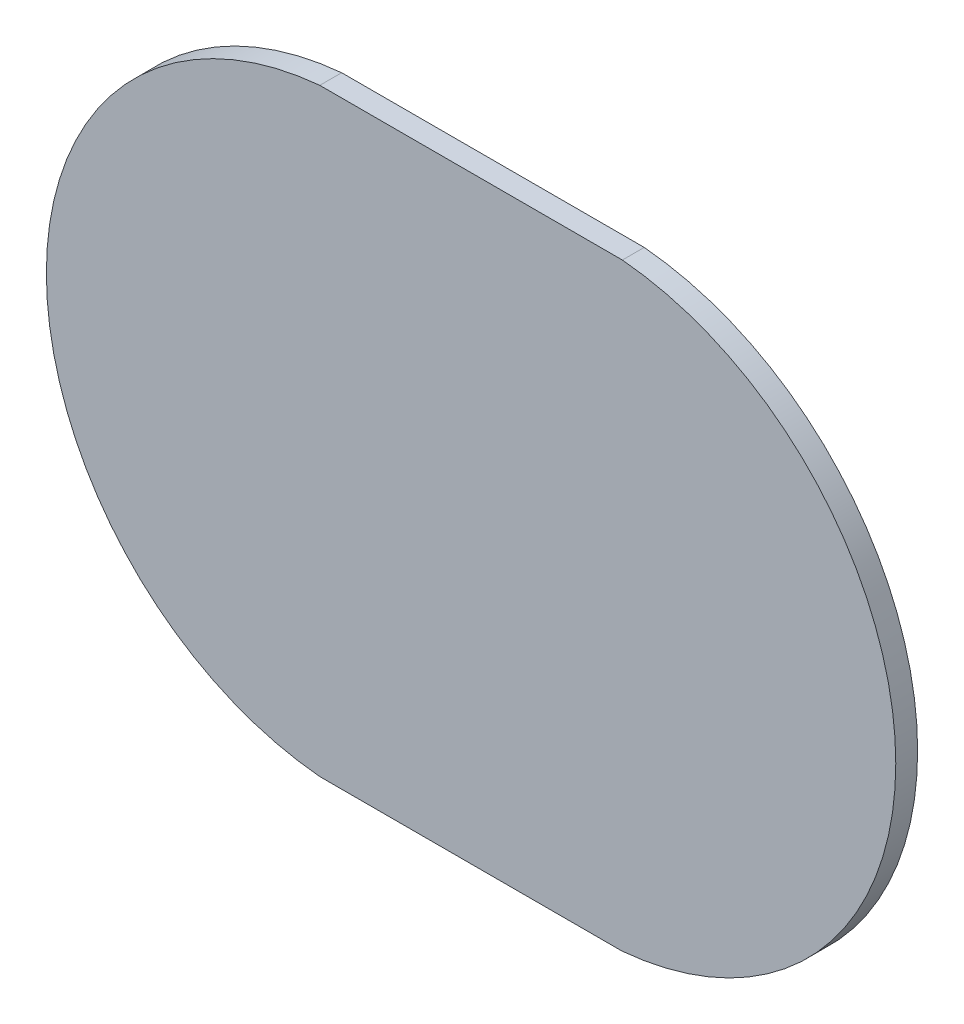
ISO-10303-21;
HEADER;
FILE_DESCRIPTION(('STEP AP214'),'2;1');
FILE_NAME('part.step','',(''),(''),'','','');
FILE_SCHEMA(('AUTOMOTIVE_DESIGN { 1 0 10303 214 1 1 1 1 }'));
ENDSEC;
DATA;
#1=APPLICATION_CONTEXT('core data for automotive mechanical design processes');
#2=APPLICATION_PROTOCOL_DEFINITION('international standard','automotive_design',2000,#1);
#3=PRODUCT_CONTEXT('',#1,'mechanical');
#4=PRODUCT('Part','Part','',(#3));
#5=PRODUCT_RELATED_PRODUCT_CATEGORY('part','',(#4));
#6=PRODUCT_DEFINITION_FORMATION('','',#4);
#7=PRODUCT_DEFINITION_CONTEXT('part definition',#1,'design');
#8=PRODUCT_DEFINITION('design','',#6,#7);
#9=PRODUCT_DEFINITION_SHAPE('','',#8);
#10=(LENGTH_UNIT() NAMED_UNIT(*) SI_UNIT(.MILLI.,.METRE.));
#11=(NAMED_UNIT(*) PLANE_ANGLE_UNIT() SI_UNIT($,.RADIAN.));
#12=(NAMED_UNIT(*) SI_UNIT($,.STERADIAN.) SOLID_ANGLE_UNIT());
#13=UNCERTAINTY_MEASURE_WITH_UNIT(LENGTH_MEASURE(1.E-05),#10,'distance_accuracy_value','');
#14=(GEOMETRIC_REPRESENTATION_CONTEXT(3) GLOBAL_UNCERTAINTY_ASSIGNED_CONTEXT((#13)) GLOBAL_UNIT_ASSIGNED_CONTEXT((#10,
#11,#12)) REPRESENTATION_CONTEXT('',''));
#15=CARTESIAN_POINT('',(0.,0.,0.));
#16=DIRECTION('',(0.,0.,1.));
#17=DIRECTION('',(1.,0.,0.));
#18=AXIS2_PLACEMENT_3D('',#15,#16,#17);
#19=CARTESIAN_POINT('',(-12.3042138671329,-1.03740541843096,-11.6112275560423));
#20=DIRECTION('',(0.,0.,1.));
#21=DIRECTION('',(0.,-1.,0.));
#22=AXIS2_PLACEMENT_3D('',#19,#20,#21);
#23=PLANE('',#22);
#24=DIRECTION('',(1.,0.,0.));
#25=VECTOR('',#24,1.);
#26=CARTESIAN_POINT('',(14.8179873780138,-5.40921753651415,-11.6112275560423));
#27=LINE('',#26,#25);
#28=CARTESIAN_POINT('',(14.8179873780138,-5.40921753651415,-11.6112275560423));
#29=VERTEX_POINT('',#28);
#30=CARTESIAN_POINT('',(15.5379702301806,-5.40921753651415,-11.6112275560423));
#31=VERTEX_POINT('',#30);
#32=EDGE_CURVE('E65',#29,#31,#27,.T.);
#33=ORIENTED_EDGE('',*,*,#32,.F.);
#34=CARTESIAN_POINT('',(14.8825373130822,-6.12148168911415,-11.6112275560423));
#35=DIRECTION('',(0.,0.,1.));
#36=DIRECTION('',(0.,-1.,0.));
#37=AXIS2_PLACEMENT_3D('',#34,#35,#36);
#38=CIRCLE('',#37,0.715183135424999);
#39=CARTESIAN_POINT('',(14.8179873780138,-6.83374584171415,-11.6112275560423));
#40=VERTEX_POINT('',#39);
#41=EDGE_CURVE('E19',#40,#29,#38,.F.);
#42=ORIENTED_EDGE('',*,*,#41,.F.);
#43=DIRECTION('',(1.,0.,0.));
#44=VECTOR('',#43,1.);
#45=CARTESIAN_POINT('',(15.5379702301807,-6.83374584171415,-11.6112275560423));
#46=LINE('',#45,#44);
#47=CARTESIAN_POINT('',(15.5379702301806,-6.83374584171415,-11.6112275560423));
#48=VERTEX_POINT('',#47);
#49=EDGE_CURVE('E52',#48,#40,#46,.F.);
#50=ORIENTED_EDGE('',*,*,#49,.F.);
#51=CARTESIAN_POINT('',(15.4734202951122,-6.12148168911415,-11.6112275560423));
#52=DIRECTION('',(0.,0.,1.));
#53=DIRECTION('',(0.,-1.,0.));
#54=AXIS2_PLACEMENT_3D('',#51,#52,#53);
#55=CIRCLE('',#54,0.715183135424999);
#56=EDGE_CURVE('E67',#31,#48,#55,.F.);
#57=ORIENTED_EDGE('',*,*,#56,.F.);
#58=EDGE_LOOP('',(#33,#42,#50,#57));
#59=FACE_BOUND('',#58,.T.);
#60=ADVANCED_FACE('F16',(#59),#23,.T.);
#61=CARTESIAN_POINT('',(14.8179873780138,-5.40921753651415,-11.6112275560423));
#62=DIRECTION('',(0.,1.,0.));
#63=DIRECTION('',(0.,0.,1.));
#64=AXIS2_PLACEMENT_3D('',#61,#62,#63);
#65=PLANE('',#64);
#66=ORIENTED_EDGE('',*,*,#32,.T.);
#67=DIRECTION('',(0.,0.,1.));
#68=VECTOR('',#67,1.);
#69=CARTESIAN_POINT('',(15.5379702301807,-5.40921753651415,-11.6112275560423));
#70=LINE('',#69,#68);
#71=CARTESIAN_POINT('',(15.5379702301806,-5.40921753651415,-11.6632275560423));
#72=VERTEX_POINT('',#71);
#73=EDGE_CURVE('E81',#72,#31,#70,.T.);
#74=ORIENTED_EDGE('',*,*,#73,.F.);
#75=DIRECTION('',(1.,0.,0.));
#76=VECTOR('',#75,1.);
#77=CARTESIAN_POINT('',(-12.3042138671329,-5.40921753651415,-11.6632275560423));
#78=LINE('',#77,#76);
#79=CARTESIAN_POINT('',(14.8179873780138,-5.40921753651415,-11.6632275560423));
#80=VERTEX_POINT('',#79);
#81=EDGE_CURVE('E74',#72,#80,#78,.F.);
#82=ORIENTED_EDGE('',*,*,#81,.T.);
#83=DIRECTION('',(0.,0.,1.));
#84=VECTOR('',#83,1.);
#85=CARTESIAN_POINT('',(14.8179873780138,-5.40921753651415,-11.6112275560423));
#86=LINE('',#85,#84);
#87=EDGE_CURVE('E61',#29,#80,#86,.F.);
#88=ORIENTED_EDGE('',*,*,#87,.F.);
#89=EDGE_LOOP('',(#66,#74,#82,#88));
#90=FACE_BOUND('',#89,.T.);
#91=ADVANCED_FACE('F73',(#90),#65,.T.);
#92=CARTESIAN_POINT('',(14.8825373130822,-6.12148168911415,-11.6112275560423));
#93=DIRECTION('',(0.,0.,1.));
#94=DIRECTION('',(0.,-1.,0.));
#95=AXIS2_PLACEMENT_3D('',#92,#93,#94);
#96=CYLINDRICAL_SURFACE('',#95,0.715183135424999);
#97=CARTESIAN_POINT('',(14.8825373130822,-6.12148168911415,-11.6632275560423));
#98=DIRECTION('',(0.,0.,1.));
#99=DIRECTION('',(0.,-1.,0.));
#100=AXIS2_PLACEMENT_3D('',#97,#98,#99);
#101=CIRCLE('',#100,0.715183135424999);
#102=CARTESIAN_POINT('',(14.8179873780138,-6.83374584171415,-11.6632275560423));
#103=VERTEX_POINT('',#102);
#104=EDGE_CURVE('E80',#80,#103,#101,.T.);
#105=ORIENTED_EDGE('',*,*,#104,.T.);
#106=DIRECTION('',(0.,0.,1.));
#107=VECTOR('',#106,1.);
#108=CARTESIAN_POINT('',(14.8179873780138,-6.83374584171415,-11.6112275560423));
#109=LINE('',#108,#107);
#110=EDGE_CURVE('E63',#40,#103,#109,.F.);
#111=ORIENTED_EDGE('',*,*,#110,.F.);
#112=ORIENTED_EDGE('',*,*,#41,.T.);
#113=ORIENTED_EDGE('',*,*,#87,.T.);
#114=EDGE_LOOP('',(#105,#111,#112,#113));
#115=FACE_BOUND('',#114,.T.);
#116=ADVANCED_FACE('F59',(#115),#96,.T.);
#117=CARTESIAN_POINT('',(15.5379702301807,-6.83374584171415,-11.6112275560423));
#118=DIRECTION('',(0.,-1.,0.));
#119=DIRECTION('',(1.,0.,0.));
#120=AXIS2_PLACEMENT_3D('',#117,#118,#119);
#121=PLANE('',#120);
#122=ORIENTED_EDGE('',*,*,#49,.T.);
#123=ORIENTED_EDGE('',*,*,#110,.T.);
#124=DIRECTION('',(1.,0.,0.));
#125=VECTOR('',#124,1.);
#126=CARTESIAN_POINT('',(-12.3042138671329,-6.83374584171415,-11.6632275560423));
#127=LINE('',#126,#125);
#128=CARTESIAN_POINT('',(15.5379702301806,-6.83374584171415,-11.6632275560423));
#129=VERTEX_POINT('',#128);
#130=EDGE_CURVE('E25',#103,#129,#127,.T.);
#131=ORIENTED_EDGE('',*,*,#130,.T.);
#132=DIRECTION('',(0.,0.,1.));
#133=VECTOR('',#132,1.);
#134=CARTESIAN_POINT('',(15.5379702301807,-6.83374584171415,-11.6112275560423));
#135=LINE('',#134,#133);
#136=EDGE_CURVE('E33',#48,#129,#135,.F.);
#137=ORIENTED_EDGE('',*,*,#136,.F.);
#138=EDGE_LOOP('',(#122,#123,#131,#137));
#139=FACE_BOUND('',#138,.T.);
#140=ADVANCED_FACE('F87',(#139),#121,.T.);
#141=CARTESIAN_POINT('',(15.4734202951122,-6.12148168911415,-11.6112275560423));
#142=DIRECTION('',(0.,0.,1.));
#143=DIRECTION('',(0.,-1.,0.));
#144=AXIS2_PLACEMENT_3D('',#141,#142,#143);
#145=CYLINDRICAL_SURFACE('',#144,0.715183135424999);
#146=ORIENTED_EDGE('',*,*,#56,.T.);
#147=ORIENTED_EDGE('',*,*,#136,.T.);
#148=CARTESIAN_POINT('',(15.4734202951122,-6.12148168911415,-11.6632275560423));
#149=DIRECTION('',(0.,0.,1.));
#150=DIRECTION('',(0.,-1.,0.));
#151=AXIS2_PLACEMENT_3D('',#148,#149,#150);
#152=CIRCLE('',#151,0.715183135424999);
#153=EDGE_CURVE('E11',#129,#72,#152,.T.);
#154=ORIENTED_EDGE('',*,*,#153,.T.);
#155=ORIENTED_EDGE('',*,*,#73,.T.);
#156=EDGE_LOOP('',(#146,#147,#154,#155));
#157=FACE_BOUND('',#156,.T.);
#158=ADVANCED_FACE('F90',(#157),#145,.T.);
#159=CARTESIAN_POINT('',(-12.3042138671329,-1.03740541843096,-11.6632275560423));
#160=DIRECTION('',(0.,0.,1.));
#161=DIRECTION('',(0.,-1.,0.));
#162=AXIS2_PLACEMENT_3D('',#159,#160,#161);
#163=PLANE('',#162);
#164=ORIENTED_EDGE('',*,*,#130,.F.);
#165=ORIENTED_EDGE('',*,*,#104,.F.);
#166=ORIENTED_EDGE('',*,*,#81,.F.);
#167=ORIENTED_EDGE('',*,*,#153,.F.);
#168=EDGE_LOOP('',(#164,#165,#166,#167));
#169=FACE_BOUND('',#168,.T.);
#170=ADVANCED_FACE('F89',(#169),#163,.F.);
#171=CLOSED_SHELL('',(#60,#91,#116,#140,#158,#170));
#172=MANIFOLD_SOLID_BREP('B1',#171);
#173=ADVANCED_BREP_SHAPE_REPRESENTATION('',(#18,#172),#14);
#174=SHAPE_DEFINITION_REPRESENTATION(#9,#173);
ENDSEC;
END-ISO-10303-21;
